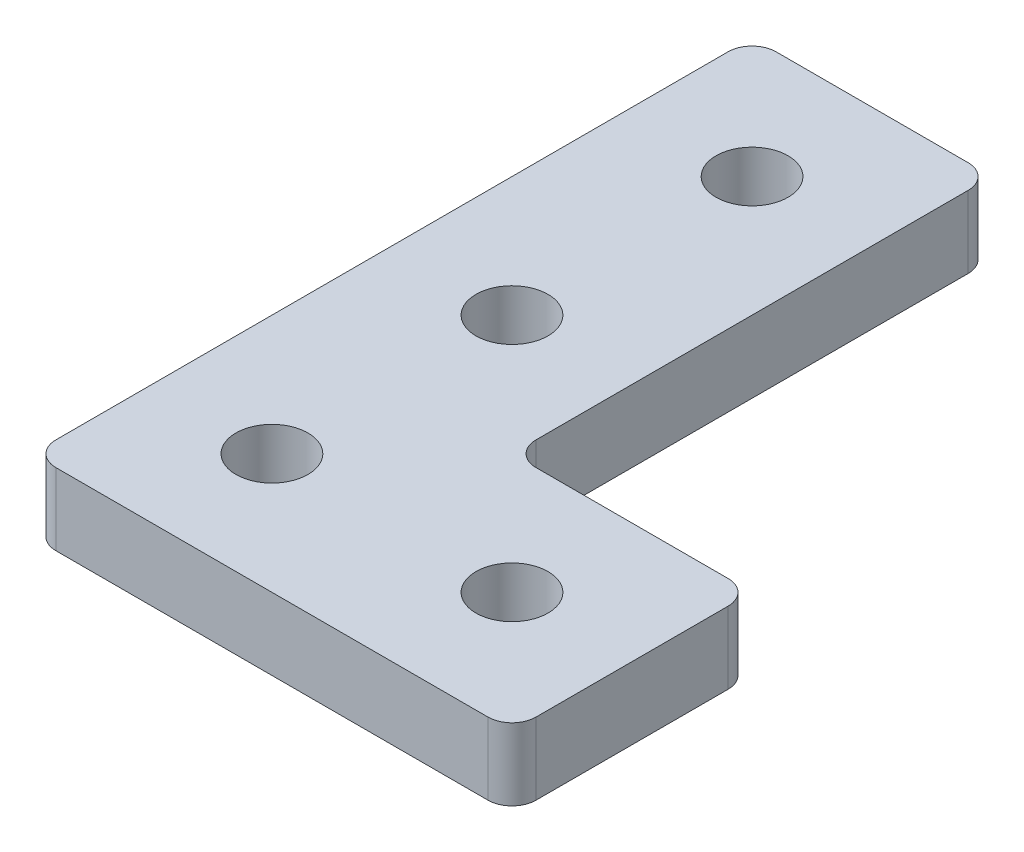
ISO-10303-21;
HEADER;
FILE_DESCRIPTION(('STEP AP214'),'2;1');
FILE_NAME('part.step','',(''),(''),'','','');
FILE_SCHEMA(('AUTOMOTIVE_DESIGN { 1 0 10303 214 1 1 1 1 }'));
ENDSEC;
DATA;
#1=APPLICATION_CONTEXT('core data for automotive mechanical design processes');
#2=APPLICATION_PROTOCOL_DEFINITION('international standard','automotive_design',2000,#1);
#3=PRODUCT_CONTEXT('',#1,'mechanical');
#4=PRODUCT('Part','Part','',(#3));
#5=PRODUCT_RELATED_PRODUCT_CATEGORY('part','',(#4));
#6=PRODUCT_DEFINITION_FORMATION('','',#4);
#7=PRODUCT_DEFINITION_CONTEXT('part definition',#1,'design');
#8=PRODUCT_DEFINITION('design','',#6,#7);
#9=PRODUCT_DEFINITION_SHAPE('','',#8);
#10=(LENGTH_UNIT() NAMED_UNIT(*) SI_UNIT(.MILLI.,.METRE.));
#11=(NAMED_UNIT(*) PLANE_ANGLE_UNIT() SI_UNIT($,.RADIAN.));
#12=(NAMED_UNIT(*) SI_UNIT($,.STERADIAN.) SOLID_ANGLE_UNIT());
#13=UNCERTAINTY_MEASURE_WITH_UNIT(LENGTH_MEASURE(1.E-05),#10,'distance_accuracy_value','');
#14=(GEOMETRIC_REPRESENTATION_CONTEXT(3) GLOBAL_UNCERTAINTY_ASSIGNED_CONTEXT((#13)) GLOBAL_UNIT_ASSIGNED_CONTEXT((#10,
#11,#12)) REPRESENTATION_CONTEXT('',''));
#15=CARTESIAN_POINT('',(0.,0.,0.));
#16=DIRECTION('',(0.,0.,1.));
#17=DIRECTION('',(1.,0.,0.));
#18=AXIS2_PLACEMENT_3D('',#15,#16,#17);
#19=CARTESIAN_POINT('',(0.,3.,0.));
#20=DIRECTION('',(0.,-1.,0.));
#21=DIRECTION('',(0.,0.,-1.));
#22=AXIS2_PLACEMENT_3D('',#19,#20,#21);
#23=PLANE('',#22);
#24=DIRECTION('',(-1.,0.,0.));
#25=VECTOR('',#24,1.);
#26=CARTESIAN_POINT('',(0.,3.,-30.));
#27=LINE('',#26,#25);
#28=CARTESIAN_POINT('',(9.,3.,-30.));
#29=VERTEX_POINT('',#28);
#30=CARTESIAN_POINT('',(1.,3.,-30.));
#31=VERTEX_POINT('',#30);
#32=EDGE_CURVE('E146',#29,#31,#27,.T.);
#33=ORIENTED_EDGE('',*,*,#32,.T.);
#34=CARTESIAN_POINT('',(1.,3.,-29.));
#35=DIRECTION('',(0.,-1.,0.));
#36=DIRECTION('',(0.,0.,-1.));
#37=AXIS2_PLACEMENT_3D('',#34,#35,#36);
#38=CIRCLE('',#37,1.);
#39=CARTESIAN_POINT('',(0.,3.,-29.));
#40=VERTEX_POINT('',#39);
#41=EDGE_CURVE('E191',#31,#40,#38,.F.);
#42=ORIENTED_EDGE('',*,*,#41,.T.);
#43=DIRECTION('',(0.,0.,1.));
#44=VECTOR('',#43,1.);
#45=CARTESIAN_POINT('',(0.,3.,0.));
#46=LINE('',#45,#44);
#47=CARTESIAN_POINT('',(0.,3.,-1.));
#48=VERTEX_POINT('',#47);
#49=EDGE_CURVE('E157',#40,#48,#46,.T.);
#50=ORIENTED_EDGE('',*,*,#49,.T.);
#51=CARTESIAN_POINT('',(0.999999999999999,3.,-1.));
#52=DIRECTION('',(0.,-1.,0.));
#53=DIRECTION('',(0.,0.,-1.));
#54=AXIS2_PLACEMENT_3D('',#51,#52,#53);
#55=CIRCLE('',#54,1.);
#56=CARTESIAN_POINT('',(0.999999999999999,3.,0.));
#57=VERTEX_POINT('',#56);
#58=EDGE_CURVE('E187',#48,#57,#55,.F.);
#59=ORIENTED_EDGE('',*,*,#58,.T.);
#60=DIRECTION('',(1.,0.,0.));
#61=VECTOR('',#60,1.);
#62=CARTESIAN_POINT('',(0.,3.,0.));
#63=LINE('',#62,#61);
#64=CARTESIAN_POINT('',(19.,3.,0.));
#65=VERTEX_POINT('',#64);
#66=EDGE_CURVE('E226',#57,#65,#63,.T.);
#67=ORIENTED_EDGE('',*,*,#66,.T.);
#68=CARTESIAN_POINT('',(19.,3.,-1.));
#69=DIRECTION('',(0.,-1.,0.));
#70=DIRECTION('',(0.,0.,-1.));
#71=AXIS2_PLACEMENT_3D('',#68,#69,#70);
#72=CIRCLE('',#71,1.);
#73=CARTESIAN_POINT('',(20.,3.,-1.));
#74=VERTEX_POINT('',#73);
#75=EDGE_CURVE('E185',#65,#74,#72,.F.);
#76=ORIENTED_EDGE('',*,*,#75,.T.);
#77=DIRECTION('',(0.,0.,-1.));
#78=VECTOR('',#77,1.);
#79=CARTESIAN_POINT('',(20.,3.,0.));
#80=LINE('',#79,#78);
#81=CARTESIAN_POINT('',(20.,3.,-9.));
#82=VERTEX_POINT('',#81);
#83=EDGE_CURVE('E208',#74,#82,#80,.T.);
#84=ORIENTED_EDGE('',*,*,#83,.T.);
#85=CARTESIAN_POINT('',(19.,3.,-9.));
#86=DIRECTION('',(0.,-1.,0.));
#87=DIRECTION('',(0.,0.,-1.));
#88=AXIS2_PLACEMENT_3D('',#85,#86,#87);
#89=CIRCLE('',#88,1.);
#90=CARTESIAN_POINT('',(19.,3.,-10.));
#91=VERTEX_POINT('',#90);
#92=EDGE_CURVE('E61',#82,#91,#89,.F.);
#93=ORIENTED_EDGE('',*,*,#92,.T.);
#94=DIRECTION('',(-1.,0.,0.));
#95=VECTOR('',#94,1.);
#96=CARTESIAN_POINT('',(10.,3.,-10.));
#97=LINE('',#96,#95);
#98=CARTESIAN_POINT('',(11.,3.,-10.));
#99=VERTEX_POINT('',#98);
#100=EDGE_CURVE('E223',#91,#99,#97,.T.);
#101=ORIENTED_EDGE('',*,*,#100,.T.);
#102=CARTESIAN_POINT('',(11.,3.,-11.));
#103=DIRECTION('',(0.,-1.,0.));
#104=DIRECTION('',(0.,0.,-1.));
#105=AXIS2_PLACEMENT_3D('',#102,#103,#104);
#106=CIRCLE('',#105,1.);
#107=CARTESIAN_POINT('',(10.,3.,-11.));
#108=VERTEX_POINT('',#107);
#109=EDGE_CURVE('E141',#99,#108,#106,.T.);
#110=ORIENTED_EDGE('',*,*,#109,.T.);
#111=DIRECTION('',(0.,0.,-1.));
#112=VECTOR('',#111,1.);
#113=CARTESIAN_POINT('',(10.,3.,-10.));
#114=LINE('',#113,#112);
#115=CARTESIAN_POINT('',(10.,3.,-29.));
#116=VERTEX_POINT('',#115);
#117=EDGE_CURVE('E145',#108,#116,#114,.T.);
#118=ORIENTED_EDGE('',*,*,#117,.T.);
#119=CARTESIAN_POINT('',(9.,3.,-29.));
#120=DIRECTION('',(0.,-1.,0.));
#121=DIRECTION('',(0.,0.,-1.));
#122=AXIS2_PLACEMENT_3D('',#119,#120,#121);
#123=CIRCLE('',#122,1.);
#124=EDGE_CURVE('E189',#116,#29,#123,.F.);
#125=ORIENTED_EDGE('',*,*,#124,.T.);
#126=EDGE_LOOP('',(#33,#42,#50,#59,#67,#76,#84,#93,#101,#110,#118,#125));
#127=FACE_BOUND('',#126,.T.);
#128=CARTESIAN_POINT('',(5.,3.,-25.));
#129=DIRECTION('',(0.,1.,0.));
#130=DIRECTION('',(0.,0.,1.));
#131=AXIS2_PLACEMENT_3D('',#128,#129,#130);
#132=CIRCLE('',#131,1.5);
#133=CARTESIAN_POINT('',(5.,3.,-23.5));
#134=VERTEX_POINT('',#133);
#135=EDGE_CURVE('E219',#134,#134,#132,.T.);
#136=ORIENTED_EDGE('',*,*,#135,.F.);
#137=EDGE_LOOP('',(#136));
#138=FACE_BOUND('',#137,.T.);
#139=CARTESIAN_POINT('',(5.0000000000001,3.,-15.));
#140=DIRECTION('',(0.,1.,0.));
#141=DIRECTION('',(0.,0.,1.));
#142=AXIS2_PLACEMENT_3D('',#139,#140,#141);
#143=CIRCLE('',#142,1.5);
#144=CARTESIAN_POINT('',(5.0000000000001,3.,-13.5));
#145=VERTEX_POINT('',#144);
#146=EDGE_CURVE('E234',#145,#145,#143,.T.);
#147=ORIENTED_EDGE('',*,*,#146,.F.);
#148=EDGE_LOOP('',(#147));
#149=FACE_BOUND('',#148,.T.);
#150=CARTESIAN_POINT('',(5.00000000000021,3.,-5.));
#151=DIRECTION('',(0.,1.,0.));
#152=DIRECTION('',(0.,0.,1.));
#153=AXIS2_PLACEMENT_3D('',#150,#151,#152);
#154=CIRCLE('',#153,1.5);
#155=CARTESIAN_POINT('',(5.00000000000021,3.,-3.5));
#156=VERTEX_POINT('',#155);
#157=EDGE_CURVE('E240',#156,#156,#154,.T.);
#158=ORIENTED_EDGE('',*,*,#157,.F.);
#159=EDGE_LOOP('',(#158));
#160=FACE_BOUND('',#159,.T.);
#161=CARTESIAN_POINT('',(15.0000000000002,3.,-5.));
#162=DIRECTION('',(0.,1.,0.));
#163=DIRECTION('',(0.,0.,1.));
#164=AXIS2_PLACEMENT_3D('',#161,#162,#163);
#165=CIRCLE('',#164,1.5);
#166=CARTESIAN_POINT('',(15.0000000000002,3.,-3.5));
#167=VERTEX_POINT('',#166);
#168=EDGE_CURVE('E246',#167,#167,#165,.T.);
#169=ORIENTED_EDGE('',*,*,#168,.F.);
#170=EDGE_LOOP('',(#169));
#171=FACE_BOUND('',#170,.T.);
#172=ADVANCED_FACE('F38',(#127,#138,#149,#160,#171),#23,.F.);
#173=CARTESIAN_POINT('',(0.,0.,0.));
#174=DIRECTION('',(0.,-1.,0.));
#175=DIRECTION('',(0.,0.,-1.));
#176=AXIS2_PLACEMENT_3D('',#173,#174,#175);
#177=PLANE('',#176);
#178=CARTESIAN_POINT('',(5.00000000000021,0.,-5.));
#179=DIRECTION('',(0.,1.,0.));
#180=DIRECTION('',(0.,0.,1.));
#181=AXIS2_PLACEMENT_3D('',#178,#179,#180);
#182=CIRCLE('',#181,1.5);
#183=CARTESIAN_POINT('',(5.00000000000021,0.,-3.5));
#184=VERTEX_POINT('',#183);
#185=EDGE_CURVE('E243',#184,#184,#182,.T.);
#186=ORIENTED_EDGE('',*,*,#185,.T.);
#187=EDGE_LOOP('',(#186));
#188=FACE_BOUND('',#187,.T.);
#189=CARTESIAN_POINT('',(5.,0.,-25.));
#190=DIRECTION('',(0.,1.,0.));
#191=DIRECTION('',(0.,0.,1.));
#192=AXIS2_PLACEMENT_3D('',#189,#190,#191);
#193=CIRCLE('',#192,1.5);
#194=CARTESIAN_POINT('',(5.,0.,-23.5));
#195=VERTEX_POINT('',#194);
#196=EDGE_CURVE('E231',#195,#195,#193,.T.);
#197=ORIENTED_EDGE('',*,*,#196,.T.);
#198=EDGE_LOOP('',(#197));
#199=FACE_BOUND('',#198,.T.);
#200=DIRECTION('',(0.,0.,1.));
#201=VECTOR('',#200,1.);
#202=CARTESIAN_POINT('',(0.,0.,0.));
#203=LINE('',#202,#201);
#204=CARTESIAN_POINT('',(0.,0.,-29.));
#205=VERTEX_POINT('',#204);
#206=CARTESIAN_POINT('',(0.,0.,-1.));
#207=VERTEX_POINT('',#206);
#208=EDGE_CURVE('E214',#205,#207,#203,.T.);
#209=ORIENTED_EDGE('',*,*,#208,.F.);
#210=CARTESIAN_POINT('',(1.,0.,-29.));
#211=DIRECTION('',(0.,-1.,0.));
#212=DIRECTION('',(0.,0.,-1.));
#213=AXIS2_PLACEMENT_3D('',#210,#211,#212);
#214=CIRCLE('',#213,1.);
#215=CARTESIAN_POINT('',(1.,0.,-30.));
#216=VERTEX_POINT('',#215);
#217=EDGE_CURVE('E177',#205,#216,#214,.T.);
#218=ORIENTED_EDGE('',*,*,#217,.T.);
#219=DIRECTION('',(-1.,0.,0.));
#220=VECTOR('',#219,1.);
#221=CARTESIAN_POINT('',(0.,0.,-30.));
#222=LINE('',#221,#220);
#223=CARTESIAN_POINT('',(9.,0.,-30.));
#224=VERTEX_POINT('',#223);
#225=EDGE_CURVE('E153',#224,#216,#222,.T.);
#226=ORIENTED_EDGE('',*,*,#225,.F.);
#227=CARTESIAN_POINT('',(9.,0.,-29.));
#228=DIRECTION('',(0.,-1.,0.));
#229=DIRECTION('',(0.,0.,-1.));
#230=AXIS2_PLACEMENT_3D('',#227,#228,#229);
#231=CIRCLE('',#230,1.);
#232=CARTESIAN_POINT('',(10.,0.,-29.));
#233=VERTEX_POINT('',#232);
#234=EDGE_CURVE('E152',#224,#233,#231,.T.);
#235=ORIENTED_EDGE('',*,*,#234,.T.);
#236=DIRECTION('',(0.,0.,-1.));
#237=VECTOR('',#236,1.);
#238=CARTESIAN_POINT('',(10.,0.,-10.));
#239=LINE('',#238,#237);
#240=CARTESIAN_POINT('',(10.,0.,-11.));
#241=VERTEX_POINT('',#240);
#242=EDGE_CURVE('E144',#241,#233,#239,.T.);
#243=ORIENTED_EDGE('',*,*,#242,.F.);
#244=CARTESIAN_POINT('',(11.,0.,-11.));
#245=DIRECTION('',(0.,-1.,0.));
#246=DIRECTION('',(0.,0.,-1.));
#247=AXIS2_PLACEMENT_3D('',#244,#245,#246);
#248=CIRCLE('',#247,1.);
#249=CARTESIAN_POINT('',(11.,0.,-10.));
#250=VERTEX_POINT('',#249);
#251=EDGE_CURVE('E131',#241,#250,#248,.F.);
#252=ORIENTED_EDGE('',*,*,#251,.T.);
#253=DIRECTION('',(-1.,0.,0.));
#254=VECTOR('',#253,1.);
#255=CARTESIAN_POINT('',(10.,0.,-10.));
#256=LINE('',#255,#254);
#257=CARTESIAN_POINT('',(19.,0.,-10.));
#258=VERTEX_POINT('',#257);
#259=EDGE_CURVE('E154',#258,#250,#256,.T.);
#260=ORIENTED_EDGE('',*,*,#259,.F.);
#261=CARTESIAN_POINT('',(19.,0.,-9.));
#262=DIRECTION('',(0.,-1.,0.));
#263=DIRECTION('',(0.,0.,-1.));
#264=AXIS2_PLACEMENT_3D('',#261,#262,#263);
#265=CIRCLE('',#264,1.);
#266=CARTESIAN_POINT('',(20.,0.,-9.));
#267=VERTEX_POINT('',#266);
#268=EDGE_CURVE('E170',#258,#267,#265,.T.);
#269=ORIENTED_EDGE('',*,*,#268,.T.);
#270=DIRECTION('',(0.,0.,-1.));
#271=VECTOR('',#270,1.);
#272=CARTESIAN_POINT('',(20.,0.,0.));
#273=LINE('',#272,#271);
#274=CARTESIAN_POINT('',(20.,0.,-1.));
#275=VERTEX_POINT('',#274);
#276=EDGE_CURVE('E159',#275,#267,#273,.T.);
#277=ORIENTED_EDGE('',*,*,#276,.F.);
#278=CARTESIAN_POINT('',(19.,0.,-1.));
#279=DIRECTION('',(0.,-1.,0.));
#280=DIRECTION('',(0.,0.,-1.));
#281=AXIS2_PLACEMENT_3D('',#278,#279,#280);
#282=CIRCLE('',#281,1.);
#283=CARTESIAN_POINT('',(19.,0.,0.));
#284=VERTEX_POINT('',#283);
#285=EDGE_CURVE('E172',#275,#284,#282,.T.);
#286=ORIENTED_EDGE('',*,*,#285,.T.);
#287=DIRECTION('',(1.,0.,0.));
#288=VECTOR('',#287,1.);
#289=CARTESIAN_POINT('',(10.,0.,0.));
#290=LINE('',#289,#288);
#291=CARTESIAN_POINT('',(0.999999999999999,0.,0.));
#292=VERTEX_POINT('',#291);
#293=EDGE_CURVE('E213',#292,#284,#290,.T.);
#294=ORIENTED_EDGE('',*,*,#293,.F.);
#295=CARTESIAN_POINT('',(0.999999999999999,0.,-1.));
#296=DIRECTION('',(0.,-1.,0.));
#297=DIRECTION('',(0.,0.,-1.));
#298=AXIS2_PLACEMENT_3D('',#295,#296,#297);
#299=CIRCLE('',#298,1.);
#300=EDGE_CURVE('E174',#292,#207,#299,.T.);
#301=ORIENTED_EDGE('',*,*,#300,.T.);
#302=EDGE_LOOP('',(#209,#218,#226,#235,#243,#252,#260,#269,#277,#286,#294,#301));
#303=FACE_BOUND('',#302,.T.);
#304=CARTESIAN_POINT('',(5.0000000000001,0.,-15.));
#305=DIRECTION('',(0.,1.,0.));
#306=DIRECTION('',(0.,0.,1.));
#307=AXIS2_PLACEMENT_3D('',#304,#305,#306);
#308=CIRCLE('',#307,1.5);
#309=CARTESIAN_POINT('',(5.0000000000001,0.,-13.5));
#310=VERTEX_POINT('',#309);
#311=EDGE_CURVE('E237',#310,#310,#308,.T.);
#312=ORIENTED_EDGE('',*,*,#311,.T.);
#313=EDGE_LOOP('',(#312));
#314=FACE_BOUND('',#313,.T.);
#315=CARTESIAN_POINT('',(15.0000000000002,0.,-5.));
#316=DIRECTION('',(0.,1.,0.));
#317=DIRECTION('',(0.,0.,1.));
#318=AXIS2_PLACEMENT_3D('',#315,#316,#317);
#319=CIRCLE('',#318,1.5);
#320=CARTESIAN_POINT('',(15.0000000000002,0.,-3.5));
#321=VERTEX_POINT('',#320);
#322=EDGE_CURVE('E249',#321,#321,#319,.T.);
#323=ORIENTED_EDGE('',*,*,#322,.T.);
#324=EDGE_LOOP('',(#323));
#325=FACE_BOUND('',#324,.T.);
#326=ADVANCED_FACE('F149',(#188,#199,#303,#314,#325),#177,.T.);
#327=CARTESIAN_POINT('',(0.,3.,0.));
#328=DIRECTION('',(1.,0.,0.));
#329=DIRECTION('',(0.,0.,-1.));
#330=AXIS2_PLACEMENT_3D('',#327,#328,#329);
#331=PLANE('',#330);
#332=ORIENTED_EDGE('',*,*,#49,.F.);
#333=DIRECTION('',(0.,-1.,0.));
#334=VECTOR('',#333,1.);
#335=CARTESIAN_POINT('',(0.,3.,-29.));
#336=LINE('',#335,#334);
#337=EDGE_CURVE('E167',#40,#205,#336,.T.);
#338=ORIENTED_EDGE('',*,*,#337,.T.);
#339=ORIENTED_EDGE('',*,*,#208,.T.);
#340=DIRECTION('',(0.,-1.,0.));
#341=VECTOR('',#340,1.);
#342=CARTESIAN_POINT('',(0.,3.,-1.));
#343=LINE('',#342,#341);
#344=EDGE_CURVE('E165',#207,#48,#343,.F.);
#345=ORIENTED_EDGE('',*,*,#344,.T.);
#346=EDGE_LOOP('',(#332,#338,#339,#345));
#347=FACE_BOUND('',#346,.T.);
#348=ADVANCED_FACE('F263',(#347),#331,.F.);
#349=CARTESIAN_POINT('',(10.,3.,0.));
#350=DIRECTION('',(0.,0.,-1.));
#351=DIRECTION('',(-1.,0.,0.));
#352=AXIS2_PLACEMENT_3D('',#349,#350,#351);
#353=PLANE('',#352);
#354=ORIENTED_EDGE('',*,*,#66,.F.);
#355=DIRECTION('',(0.,-1.,0.));
#356=VECTOR('',#355,1.);
#357=CARTESIAN_POINT('',(0.999999999999999,3.,0.));
#358=LINE('',#357,#356);
#359=EDGE_CURVE('E196',#57,#292,#358,.T.);
#360=ORIENTED_EDGE('',*,*,#359,.T.);
#361=ORIENTED_EDGE('',*,*,#293,.T.);
#362=DIRECTION('',(0.,-1.,0.));
#363=VECTOR('',#362,1.);
#364=CARTESIAN_POINT('',(19.,3.,0.));
#365=LINE('',#364,#363);
#366=EDGE_CURVE('E194',#284,#65,#365,.F.);
#367=ORIENTED_EDGE('',*,*,#366,.T.);
#368=EDGE_LOOP('',(#354,#360,#361,#367));
#369=FACE_BOUND('',#368,.T.);
#370=ADVANCED_FACE('F283',(#369),#353,.F.);
#371=CARTESIAN_POINT('',(20.,3.,0.));
#372=DIRECTION('',(-1.,0.,0.));
#373=DIRECTION('',(0.,0.,1.));
#374=AXIS2_PLACEMENT_3D('',#371,#372,#373);
#375=PLANE('',#374);
#376=ORIENTED_EDGE('',*,*,#83,.F.);
#377=DIRECTION('',(0.,-1.,0.));
#378=VECTOR('',#377,1.);
#379=CARTESIAN_POINT('',(20.,3.,-1.));
#380=LINE('',#379,#378);
#381=EDGE_CURVE('E46',#74,#275,#380,.T.);
#382=ORIENTED_EDGE('',*,*,#381,.T.);
#383=ORIENTED_EDGE('',*,*,#276,.T.);
#384=DIRECTION('',(0.,-1.,0.));
#385=VECTOR('',#384,1.);
#386=CARTESIAN_POINT('',(20.,3.,-9.));
#387=LINE('',#386,#385);
#388=EDGE_CURVE('E199',#267,#82,#387,.F.);
#389=ORIENTED_EDGE('',*,*,#388,.T.);
#390=EDGE_LOOP('',(#376,#382,#383,#389));
#391=FACE_BOUND('',#390,.T.);
#392=ADVANCED_FACE('F206',(#391),#375,.F.);
#393=CARTESIAN_POINT('',(10.,3.,-10.));
#394=DIRECTION('',(0.,0.,1.));
#395=DIRECTION('',(1.,0.,0.));
#396=AXIS2_PLACEMENT_3D('',#393,#394,#395);
#397=PLANE('',#396);
#398=ORIENTED_EDGE('',*,*,#100,.F.);
#399=DIRECTION('',(0.,-1.,0.));
#400=VECTOR('',#399,1.);
#401=CARTESIAN_POINT('',(19.,3.,-10.));
#402=LINE('',#401,#400);
#403=EDGE_CURVE('E11',#91,#258,#402,.T.);
#404=ORIENTED_EDGE('',*,*,#403,.T.);
#405=ORIENTED_EDGE('',*,*,#259,.T.);
#406=DIRECTION('',(0.,-1.,0.));
#407=VECTOR('',#406,1.);
#408=CARTESIAN_POINT('',(11.,3.,-10.));
#409=LINE('',#408,#407);
#410=EDGE_CURVE('E137',#250,#99,#409,.F.);
#411=ORIENTED_EDGE('',*,*,#410,.T.);
#412=EDGE_LOOP('',(#398,#404,#405,#411));
#413=FACE_BOUND('',#412,.T.);
#414=ADVANCED_FACE('F277',(#413),#397,.F.);
#415=CARTESIAN_POINT('',(10.,3.,-10.));
#416=DIRECTION('',(-1.,0.,0.));
#417=DIRECTION('',(0.,0.,1.));
#418=AXIS2_PLACEMENT_3D('',#415,#416,#417);
#419=PLANE('',#418);
#420=ORIENTED_EDGE('',*,*,#242,.T.);
#421=DIRECTION('',(0.,-1.,0.));
#422=VECTOR('',#421,1.);
#423=CARTESIAN_POINT('',(10.,3.,-29.));
#424=LINE('',#423,#422);
#425=EDGE_CURVE('E53',#233,#116,#424,.F.);
#426=ORIENTED_EDGE('',*,*,#425,.T.);
#427=ORIENTED_EDGE('',*,*,#117,.F.);
#428=DIRECTION('',(0.,-1.,0.));
#429=VECTOR('',#428,1.);
#430=CARTESIAN_POINT('',(10.,0.,-11.));
#431=LINE('',#430,#429);
#432=EDGE_CURVE('E135',#108,#241,#431,.T.);
#433=ORIENTED_EDGE('',*,*,#432,.T.);
#434=EDGE_LOOP('',(#420,#426,#427,#433));
#435=FACE_BOUND('',#434,.T.);
#436=ADVANCED_FACE('F143',(#435),#419,.F.);
#437=CARTESIAN_POINT('',(0.,3.,-30.));
#438=DIRECTION('',(0.,0.,1.));
#439=DIRECTION('',(1.,0.,0.));
#440=AXIS2_PLACEMENT_3D('',#437,#438,#439);
#441=PLANE('',#440);
#442=ORIENTED_EDGE('',*,*,#225,.T.);
#443=DIRECTION('',(0.,-1.,0.));
#444=VECTOR('',#443,1.);
#445=CARTESIAN_POINT('',(1.,3.,-30.));
#446=LINE('',#445,#444);
#447=EDGE_CURVE('E182',#216,#31,#446,.F.);
#448=ORIENTED_EDGE('',*,*,#447,.T.);
#449=ORIENTED_EDGE('',*,*,#32,.F.);
#450=DIRECTION('',(0.,-1.,0.));
#451=VECTOR('',#450,1.);
#452=CARTESIAN_POINT('',(9.,3.,-30.));
#453=LINE('',#452,#451);
#454=EDGE_CURVE('E179',#29,#224,#453,.T.);
#455=ORIENTED_EDGE('',*,*,#454,.T.);
#456=EDGE_LOOP('',(#442,#448,#449,#455));
#457=FACE_BOUND('',#456,.T.);
#458=ADVANCED_FACE('F271',(#457),#441,.F.);
#459=CARTESIAN_POINT('',(5.,3.,-25.));
#460=DIRECTION('',(0.,-1.,0.));
#461=DIRECTION('',(0.,0.,-1.));
#462=AXIS2_PLACEMENT_3D('',#459,#460,#461);
#463=CYLINDRICAL_SURFACE('',#462,1.5);
#464=ORIENTED_EDGE('',*,*,#135,.T.);
#465=EDGE_LOOP('',(#464));
#466=FACE_BOUND('',#465,.T.);
#467=ORIENTED_EDGE('',*,*,#196,.F.);
#468=EDGE_LOOP('',(#467));
#469=FACE_BOUND('',#468,.T.);
#470=ADVANCED_FACE('F268',(#466,#469),#463,.F.);
#471=CARTESIAN_POINT('',(5.0000000000001,3.,-15.));
#472=DIRECTION('',(0.,-1.,0.));
#473=DIRECTION('',(0.,0.,-1.));
#474=AXIS2_PLACEMENT_3D('',#471,#472,#473);
#475=CYLINDRICAL_SURFACE('',#474,1.5);
#476=ORIENTED_EDGE('',*,*,#146,.T.);
#477=EDGE_LOOP('',(#476));
#478=FACE_BOUND('',#477,.T.);
#479=ORIENTED_EDGE('',*,*,#311,.F.);
#480=EDGE_LOOP('',(#479));
#481=FACE_BOUND('',#480,.T.);
#482=ADVANCED_FACE('F419',(#478,#481),#475,.F.);
#483=CARTESIAN_POINT('',(5.00000000000021,3.,-5.));
#484=DIRECTION('',(0.,-1.,0.));
#485=DIRECTION('',(0.,0.,-1.));
#486=AXIS2_PLACEMENT_3D('',#483,#484,#485);
#487=CYLINDRICAL_SURFACE('',#486,1.5);
#488=ORIENTED_EDGE('',*,*,#157,.T.);
#489=EDGE_LOOP('',(#488));
#490=FACE_BOUND('',#489,.T.);
#491=ORIENTED_EDGE('',*,*,#185,.F.);
#492=EDGE_LOOP('',(#491));
#493=FACE_BOUND('',#492,.T.);
#494=ADVANCED_FACE('F410',(#490,#493),#487,.F.);
#495=CARTESIAN_POINT('',(15.0000000000002,3.,-5.));
#496=DIRECTION('',(0.,-1.,0.));
#497=DIRECTION('',(0.,0.,-1.));
#498=AXIS2_PLACEMENT_3D('',#495,#496,#497);
#499=CYLINDRICAL_SURFACE('',#498,1.5);
#500=ORIENTED_EDGE('',*,*,#168,.T.);
#501=EDGE_LOOP('',(#500));
#502=FACE_BOUND('',#501,.T.);
#503=ORIENTED_EDGE('',*,*,#322,.F.);
#504=EDGE_LOOP('',(#503));
#505=FACE_BOUND('',#504,.T.);
#506=ADVANCED_FACE('F255',(#502,#505),#499,.F.);
#507=CARTESIAN_POINT('',(11.,3.,-11.));
#508=DIRECTION('',(0.,1.,0.));
#509=DIRECTION('',(0.,0.,1.));
#510=AXIS2_PLACEMENT_3D('',#507,#508,#509);
#511=CYLINDRICAL_SURFACE('',#510,1.);
#512=ORIENTED_EDGE('',*,*,#109,.F.);
#513=ORIENTED_EDGE('',*,*,#410,.F.);
#514=ORIENTED_EDGE('',*,*,#251,.F.);
#515=ORIENTED_EDGE('',*,*,#432,.F.);
#516=EDGE_LOOP('',(#512,#513,#514,#515));
#517=FACE_BOUND('',#516,.T.);
#518=ADVANCED_FACE('F134',(#517),#511,.F.);
#519=CARTESIAN_POINT('',(1.,3.,-29.));
#520=DIRECTION('',(0.,-1.,0.));
#521=DIRECTION('',(0.,0.,-1.));
#522=AXIS2_PLACEMENT_3D('',#519,#520,#521);
#523=CYLINDRICAL_SURFACE('',#522,1.);
#524=ORIENTED_EDGE('',*,*,#41,.F.);
#525=ORIENTED_EDGE('',*,*,#447,.F.);
#526=ORIENTED_EDGE('',*,*,#217,.F.);
#527=ORIENTED_EDGE('',*,*,#337,.F.);
#528=EDGE_LOOP('',(#524,#525,#526,#527));
#529=FACE_BOUND('',#528,.T.);
#530=ADVANCED_FACE('F292',(#529),#523,.T.);
#531=CARTESIAN_POINT('',(9.,3.,-29.));
#532=DIRECTION('',(0.,-1.,0.));
#533=DIRECTION('',(0.,0.,-1.));
#534=AXIS2_PLACEMENT_3D('',#531,#532,#533);
#535=CYLINDRICAL_SURFACE('',#534,1.);
#536=ORIENTED_EDGE('',*,*,#124,.F.);
#537=ORIENTED_EDGE('',*,*,#425,.F.);
#538=ORIENTED_EDGE('',*,*,#234,.F.);
#539=ORIENTED_EDGE('',*,*,#454,.F.);
#540=EDGE_LOOP('',(#536,#537,#538,#539));
#541=FACE_BOUND('',#540,.T.);
#542=ADVANCED_FACE('F295',(#541),#535,.T.);
#543=CARTESIAN_POINT('',(0.999999999999999,3.,-1.));
#544=DIRECTION('',(0.,-1.,0.));
#545=DIRECTION('',(0.,0.,-1.));
#546=AXIS2_PLACEMENT_3D('',#543,#544,#545);
#547=CYLINDRICAL_SURFACE('',#546,1.);
#548=ORIENTED_EDGE('',*,*,#58,.F.);
#549=ORIENTED_EDGE('',*,*,#344,.F.);
#550=ORIENTED_EDGE('',*,*,#300,.F.);
#551=ORIENTED_EDGE('',*,*,#359,.F.);
#552=EDGE_LOOP('',(#548,#549,#550,#551));
#553=FACE_BOUND('',#552,.T.);
#554=ADVANCED_FACE('F299',(#553),#547,.T.);
#555=CARTESIAN_POINT('',(19.,3.,-1.));
#556=DIRECTION('',(0.,-1.,0.));
#557=DIRECTION('',(0.,0.,-1.));
#558=AXIS2_PLACEMENT_3D('',#555,#556,#557);
#559=CYLINDRICAL_SURFACE('',#558,1.);
#560=ORIENTED_EDGE('',*,*,#75,.F.);
#561=ORIENTED_EDGE('',*,*,#366,.F.);
#562=ORIENTED_EDGE('',*,*,#285,.F.);
#563=ORIENTED_EDGE('',*,*,#381,.F.);
#564=EDGE_LOOP('',(#560,#561,#562,#563));
#565=FACE_BOUND('',#564,.T.);
#566=ADVANCED_FACE('F302',(#565),#559,.T.);
#567=CARTESIAN_POINT('',(19.,3.,-9.));
#568=DIRECTION('',(0.,-1.,0.));
#569=DIRECTION('',(0.,0.,-1.));
#570=AXIS2_PLACEMENT_3D('',#567,#568,#569);
#571=CYLINDRICAL_SURFACE('',#570,1.);
#572=ORIENTED_EDGE('',*,*,#92,.F.);
#573=ORIENTED_EDGE('',*,*,#388,.F.);
#574=ORIENTED_EDGE('',*,*,#268,.F.);
#575=ORIENTED_EDGE('',*,*,#403,.F.);
#576=EDGE_LOOP('',(#572,#573,#574,#575));
#577=FACE_BOUND('',#576,.T.);
#578=ADVANCED_FACE('F40',(#577),#571,.T.);
#579=CLOSED_SHELL('',(#172,#326,#348,#370,#392,#414,#436,#458,#470,#482,#494,#506,#518,#530,
#542,#554,#566,#578));
#580=MANIFOLD_SOLID_BREP('B2',#579);
#581=ADVANCED_BREP_SHAPE_REPRESENTATION('',(#18,#580),#14);
#582=SHAPE_DEFINITION_REPRESENTATION(#9,#581);
ENDSEC;
END-ISO-10303-21;
